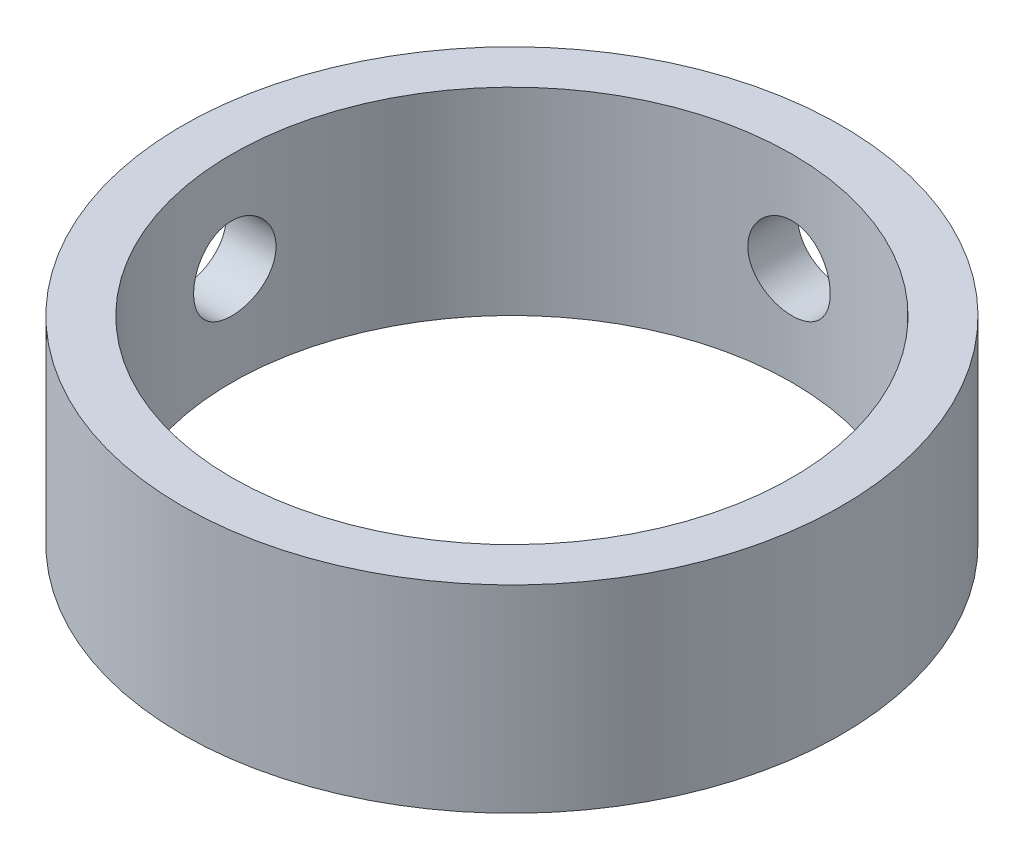
ISO-10303-21;
HEADER;
FILE_DESCRIPTION(('STEP AP214'),'2;1');
FILE_NAME('part.step','',(''),(''),'','','');
FILE_SCHEMA(('AUTOMOTIVE_DESIGN { 1 0 10303 214 1 1 1 1 }'));
ENDSEC;
DATA;
#1=APPLICATION_CONTEXT('core data for automotive mechanical design processes');
#2=APPLICATION_PROTOCOL_DEFINITION('international standard','automotive_design',2000,#1);
#3=PRODUCT_CONTEXT('',#1,'mechanical');
#4=PRODUCT('Part','Part','',(#3));
#5=PRODUCT_RELATED_PRODUCT_CATEGORY('part','',(#4));
#6=PRODUCT_DEFINITION_FORMATION('','',#4);
#7=PRODUCT_DEFINITION_CONTEXT('part definition',#1,'design');
#8=PRODUCT_DEFINITION('design','',#6,#7);
#9=PRODUCT_DEFINITION_SHAPE('','',#8);
#10=(LENGTH_UNIT() NAMED_UNIT(*) SI_UNIT(.MILLI.,.METRE.));
#11=(NAMED_UNIT(*) PLANE_ANGLE_UNIT() SI_UNIT($,.RADIAN.));
#12=(NAMED_UNIT(*) SI_UNIT($,.STERADIAN.) SOLID_ANGLE_UNIT());
#13=UNCERTAINTY_MEASURE_WITH_UNIT(LENGTH_MEASURE(1.E-05),#10,'distance_accuracy_value','');
#14=(GEOMETRIC_REPRESENTATION_CONTEXT(3) GLOBAL_UNCERTAINTY_ASSIGNED_CONTEXT((#13)) GLOBAL_UNIT_ASSIGNED_CONTEXT((#10,
#11,#12)) REPRESENTATION_CONTEXT('',''));
#15=CARTESIAN_POINT('',(0.,0.,0.));
#16=DIRECTION('',(0.,0.,1.));
#17=DIRECTION('',(1.,0.,0.));
#18=AXIS2_PLACEMENT_3D('',#15,#16,#17);
#19=CARTESIAN_POINT('',(0.,12.,0.));
#20=DIRECTION('',(0.,-1.,0.));
#21=DIRECTION('',(0.,0.,-1.));
#22=AXIS2_PLACEMENT_3D('',#19,#20,#21);
#23=CYLINDRICAL_SURFACE('',#22,20.);
#24=CARTESIAN_POINT('',(0.,12.,0.));
#25=DIRECTION('',(0.,1.,0.));
#26=DIRECTION('',(0.,0.,1.));
#27=AXIS2_PLACEMENT_3D('',#24,#25,#26);
#28=CIRCLE('',#27,20.);
#29=CARTESIAN_POINT('',(0.,12.,20.));
#30=VERTEX_POINT('',#29);
#31=EDGE_CURVE('E10',#30,#30,#28,.T.);
#32=ORIENTED_EDGE('',*,*,#31,.F.);
#33=EDGE_LOOP('',(#32));
#34=FACE_BOUND('',#33,.T.);
#35=CARTESIAN_POINT('',(0.,0.,0.));
#36=DIRECTION('',(0.,1.,0.));
#37=DIRECTION('',(0.,0.,1.));
#38=AXIS2_PLACEMENT_3D('',#35,#36,#37);
#39=CIRCLE('',#38,20.);
#40=CARTESIAN_POINT('',(0.,0.,20.));
#41=VERTEX_POINT('',#40);
#42=EDGE_CURVE('E27',#41,#41,#39,.T.);
#43=ORIENTED_EDGE('',*,*,#42,.T.);
#44=EDGE_LOOP('',(#43));
#45=FACE_BOUND('',#44,.T.);
#46=CARTESIAN_POINT('',(0.,8.5,-20.));
#47=CARTESIAN_POINT('',(0.139841095555761,8.49999405906428,-19.9999980489643));
#48=CARTESIAN_POINT('',(0.279769574302746,8.48822712083072,-19.998517845549));
#49=CARTESIAN_POINT('',(0.555732802089752,8.44147224542921,-19.9927554011136));
#50=CARTESIAN_POINT('',(0.691763330623745,8.40646006207662,-19.9884702344143));
#51=CARTESIAN_POINT('',(0.955895574813054,8.31426235608592,-19.9775806104441));
#52=CARTESIAN_POINT('',(1.08400256014614,8.25709175819015,-19.9709777145554));
#53=CARTESIAN_POINT('',(1.32877947489303,8.12223271603021,-19.956187008781));
#54=CARTESIAN_POINT('',(1.44545136155637,8.04454779146929,-19.9479994708411));
#55=CARTESIAN_POINT('',(1.66471281693132,7.87040805016041,-19.9309032130632));
#56=CARTESIAN_POINT('',(1.76723036493713,7.77386287065376,-19.9219911469242));
#57=CARTESIAN_POINT('',(1.95465279355749,7.56493717646336,-19.9044772600975));
#58=CARTESIAN_POINT('',(2.03955677639225,7.45255585508675,-19.8958754552427));
#59=CARTESIAN_POINT('',(2.18961016128394,7.21468002243433,-19.8799230561958));
#60=CARTESIAN_POINT('',(2.25469209594107,7.08914263843206,-19.8725767717791));
#61=CARTESIAN_POINT('',(2.36282307657512,6.82881294805264,-19.8600112845768));
#62=CARTESIAN_POINT('',(2.40587295806522,6.69402099285299,-19.8547920011314));
#63=CARTESIAN_POINT('',(2.46849898002476,6.41975580441324,-19.8471033960362));
#64=CARTESIAN_POINT('',(2.4881967147317,6.28031074229581,-19.8446198343675));
#65=CARTESIAN_POINT('',(2.50393554955723,6.00007373652817,-19.8426402814279));
#66=CARTESIAN_POINT('',(2.49997760100242,5.85928184726871,-19.8431441700151));
#67=CARTESIAN_POINT('',(2.4686172364479,5.58119517275122,-19.8470695536975));
#68=CARTESIAN_POINT('',(2.4413487629847,5.44388501379974,-19.8504743796033));
#69=CARTESIAN_POINT('',(2.36435038318205,5.17580497878102,-19.8597919975763));
#70=CARTESIAN_POINT('',(2.31462002175191,5.04503523528596,-19.8657048404572));
#71=CARTESIAN_POINT('',(2.19396555991165,4.79333200097831,-19.8793911586465));
#72=CARTESIAN_POINT('',(2.12298325370764,4.67242669975102,-19.8871697321144));
#73=CARTESIAN_POINT('',(1.96188146945692,4.44419330558675,-19.903707114306));
#74=CARTESIAN_POINT('',(1.87176111608078,4.33686583402632,-19.9124659678566));
#75=CARTESIAN_POINT('',(1.67419911075378,4.13805728927726,-19.9300510989043));
#76=CARTESIAN_POINT('',(1.56664200784001,4.04669090823402,-19.9388774238689));
#77=CARTESIAN_POINT('',(1.33765716911392,3.88329111996945,-19.9555463255585));
#78=CARTESIAN_POINT('',(1.21622940131825,3.811257757328,-19.9633889000151));
#79=CARTESIAN_POINT('',(0.962861671363482,3.68856867953609,-19.9772115221858));
#80=CARTESIAN_POINT('',(0.830918195337718,3.63792014611877,-19.9831909440154));
#81=CARTESIAN_POINT('',(0.560307940431058,3.55952950647675,-19.9926078578006));
#82=CARTESIAN_POINT('',(0.421641476630668,3.53178632786295,-19.9960454687587));
#83=CARTESIAN_POINT('',(0.142513163913498,3.50014257573945,-19.9999759641076));
#84=CARTESIAN_POINT('',(0.00206949019860751,3.49608400763593,-20.0004883614263));
#85=CARTESIAN_POINT('',(-0.277496036497496,3.51150773405595,-19.9985633800543));
#86=CARTESIAN_POINT('',(-0.416617917564706,3.53098952725159,-19.9961260641821));
#87=CARTESIAN_POINT('',(-0.689124507721522,3.59280970877438,-19.9885876875669));
#88=CARTESIAN_POINT('',(-0.822526570424705,3.63507276340263,-19.9834954081387));
#89=CARTESIAN_POINT('',(-1.08034965485841,3.74117745191292,-19.971217231002));
#90=CARTESIAN_POINT('',(-1.20477037146531,3.80501981849143,-19.9640312622062));
#91=CARTESIAN_POINT('',(-1.44180452068743,3.95285313750746,-19.9483182291011));
#92=CARTESIAN_POINT('',(-1.55435375994382,4.03694628980564,-19.9397844404251));
#93=CARTESIAN_POINT('',(-1.76379698962632,4.2227494975342,-19.9223514232566));
#94=CARTESIAN_POINT('',(-1.86069035833686,4.32446025225099,-19.913452180269));
#95=CARTESIAN_POINT('',(-2.03663195881802,4.54330741675714,-19.8962310546259));
#96=CARTESIAN_POINT('',(-2.11557546056793,4.66052834631039,-19.8879127472133));
#97=CARTESIAN_POINT('',(-2.2526528894435,4.90665824485471,-19.8728541103715));
#98=CARTESIAN_POINT('',(-2.31078723372837,5.03556697947652,-19.8661137493103));
#99=CARTESIAN_POINT('',(-2.40442657886654,5.30107531914762,-19.8549985039299));
#100=CARTESIAN_POINT('',(-2.43999062745711,5.43765383004798,-19.8506174518479));
#101=CARTESIAN_POINT('',(-2.48766999386785,5.71490248378067,-19.8446991590745));
#102=CARTESIAN_POINT('',(-2.49978640253576,5.85557243595901,-19.8431617860877));
#103=CARTESIAN_POINT('',(-2.50020653608484,6.13596892920468,-19.8431087698245));
#104=CARTESIAN_POINT('',(-2.48867479769927,6.27569524833189,-19.8445722475195));
#105=CARTESIAN_POINT('',(-2.44247440484932,6.55120712934508,-19.850311145372));
#106=CARTESIAN_POINT('',(-2.40780574790577,6.68699269080879,-19.8545865658308));
#107=CARTESIAN_POINT('',(-2.31636707368966,6.9507469567664,-19.8654611577455));
#108=CARTESIAN_POINT('',(-2.25960498097093,7.07871844502181,-19.8720594959278));
#109=CARTESIAN_POINT('',(-2.12560690215031,7.32334665404831,-19.8868378324482));
#110=CARTESIAN_POINT('',(-2.04837065950959,7.44000323301983,-19.8950178506041));
#111=CARTESIAN_POINT('',(-1.87500633126584,7.65953122534047,-19.9121060475223));
#112=CARTESIAN_POINT('',(-1.77875562577496,7.76230546095498,-19.9210187208403));
#113=CARTESIAN_POINT('',(-1.57035022696838,7.95030682516797,-19.938528315929));
#114=CARTESIAN_POINT('',(-1.45819178914157,8.03552981077431,-19.9471251627559));
#115=CARTESIAN_POINT('',(-1.22066562085421,8.18628535710529,-19.9630705658675));
#116=CARTESIAN_POINT('',(-1.09524927959617,8.25174180589926,-19.970414250783));
#117=CARTESIAN_POINT('',(-0.835182902301284,8.36057124291628,-19.9829764907672));
#118=CARTESIAN_POINT('',(-0.700543080870238,8.40396822635345,-19.9881973536957));
#119=CARTESIAN_POINT('',(-0.471005771967927,8.4570593381713,-19.9946672032774));
#120=CARTESIAN_POINT('',(-0.377555663516923,8.47313894198206,-19.9966572589545));
#121=CARTESIAN_POINT('',(-0.189417063212437,8.49461124569322,-19.9993243132919));
#122=CARTESIAN_POINT('',(-0.094728580496028,8.5000040243993,-20.0000013216347));
#123=CARTESIAN_POINT('',(0.,8.5,-20.));
#124=B_SPLINE_CURVE_WITH_KNOTS('',3,(#46,#47,#48,#49,#50,#51,#52,#53,#54,#55,#56,#57,#58,#59,
#60,#61,#62,#63,#64,#65,#66,#67,#68,#69,#70,#71,#72,#73,#74,#75,#76,#77,#78,#79,#80,#81,#82,#83,
#84,#85,#86,#87,#88,#89,#90,#91,#92,#93,#94,#95,#96,#97,#98,#99,#100,#101,#102,#103,#104,#105,
#106,#107,#108,#109,#110,#111,#112,#113,#114,#115,#116,#117,#118,#119,#120,#121,#122,#123),
.UNSPECIFIED.,.T.,.F.,(4,2,2,2,2,2,2,2,2,2,2,2,2,2,2,2,2,2,2,2,2,2,2,2,2,2,2,2,2,2,2,2,2,2,2,2,
2,2,4),(0.,0.419177272776246,0.838792460943426,1.25812550818177,1.67738665591073,
2.09870813201843,2.52005107800011,2.9428125031887,3.36555789496807,3.78609225286321,
4.20660969884663,4.62472696441692,5.04285270166241,5.46213426285534,5.88143500513639,
6.30363478136417,6.72583553113114,7.14817795731605,7.5705006090378,7.99000279391921,
8.40949604501929,8.82761053893396,9.24573923078948,9.66602402928422,10.0863255137509,
10.5090197150757,10.9317054422154,11.3532807428093,11.7748364301062,12.1934690120222,
12.6121016387955,13.0305842470649,13.4490720991226,13.8703523769183,14.2917319847001,
14.7147140303685,15.1372349868403,15.4211884318763,15.7051397830044),.UNSPECIFIED.);
#125=CARTESIAN_POINT('',(0.,8.5,-20.));
#126=VERTEX_POINT('',#125);
#127=EDGE_CURVE('E43',#126,#126,#124,.T.);
#128=ORIENTED_EDGE('',*,*,#127,.F.);
#129=EDGE_LOOP('',(#128));
#130=FACE_BOUND('',#129,.T.);
#131=CARTESIAN_POINT('',(-19.8431348329845,6.,2.5));
#132=CARTESIAN_POINT('',(-19.8431368414674,6.13983628380046,2.49999405483338));
#133=CARTESIAN_POINT('',(-19.8446289499888,6.2797599649306,2.48822789901659));
#134=CARTESIAN_POINT('',(-19.8504339085542,6.55571322542846,2.44147641371667));
#135=CARTESIAN_POINT('',(-19.8547497060959,6.69173858050178,2.4064668210908));
#136=CARTESIAN_POINT('',(-19.8657057380876,6.95585988210762,2.31427669282773));
#137=CARTESIAN_POINT('',(-19.8723443946258,7.08396114211641,2.25711120479872));
#138=CARTESIAN_POINT('',(-19.8871962351098,7.32872845182533,2.12226419842905));
#139=CARTESIAN_POINT('',(-19.8954091498188,7.44539645174366,2.04458618737466));
#140=CARTESIAN_POINT('',(-19.9125355924631,7.66466224712152,1.87045345026455));
#141=CARTESIAN_POINT('',(-19.9214524170269,7.76718680231872,1.77390681502433));
#142=CARTESIAN_POINT('',(-19.9389523287519,7.95462276893924,1.56497526067119));
#143=CARTESIAN_POINT('',(-19.9475353992921,8.03953330409474,1.45258955405802));
#144=CARTESIAN_POINT('',(-19.96343444613,8.18959357950632,1.21470983067598));
#145=CARTESIAN_POINT('',(-19.9707461384685,8.25467704509965,1.08917369556111));
#146=CARTESIAN_POINT('',(-19.9832423695448,8.36281119994098,0.828846718055913));
#147=CARTESIAN_POINT('',(-19.9884269872295,8.40586270692652,0.694056219360904));
#148=CARTESIAN_POINT('',(-19.9960616870624,8.46849206833442,0.419795687751112));
#149=CARTESIAN_POINT('',(-19.9985259483594,8.48819167852389,0.280353859663377));
#150=CARTESIAN_POINT('',(-20.0004906972921,8.50393538503654,0.000123200686544896));
#151=CARTESIAN_POINT('',(-19.9999913015208,8.49998041195255,-0.140665576994773));
#152=CARTESIAN_POINT('',(-19.9960964777001,8.46862479724258,-0.418765268974549));
#153=CARTESIAN_POINT('',(-19.9927172245573,8.44135510151863,-0.556091205764454));
#154=CARTESIAN_POINT('',(-19.9834605594233,8.36434882337007,-0.824202163905376));
#155=CARTESIAN_POINT('',(-19.9775830999405,8.31461181383317,-0.954987060856207));
#156=CARTESIAN_POINT('',(-19.9639625780791,8.19394350721621,-1.20670881543864));
#157=CARTESIAN_POINT('',(-19.9562145384324,8.12295554226982,-1.32761822784052));
#158=CARTESIAN_POINT('',(-19.9397196906528,7.96184163778397,-1.55585745230648));
#159=CARTESIAN_POINT('',(-19.9309728367226,7.87171482053143,-1.66318664121736));
#160=CARTESIAN_POINT('',(-19.9133886752352,7.67414818140162,-1.86198803077295));
#161=CARTESIAN_POINT('',(-19.9045511580473,7.56659424045334,-1.953346839996));
#162=CARTESIAN_POINT('',(-19.8878407194058,7.33761844321755,-2.11673285062511));
#163=CARTESIAN_POINT('',(-19.8799678009758,7.21619654346195,-2.1887599914351));
#164=CARTESIAN_POINT('',(-19.8660780261272,6.96283050443768,-2.31144457358274));
#165=CARTESIAN_POINT('',(-19.8600619590813,6.8308819200468,-2.36209292986233));
#166=CARTESIAN_POINT('',(-19.8505824249596,6.56026054647317,-2.44048165446809));
#167=CARTESIAN_POINT('',(-19.847118834867,6.42158808169128,-2.46822312679962));
#168=CARTESIAN_POINT('',(-19.8431588878405,6.14245681800023,-2.49986043190861));
#169=CARTESIAN_POINT('',(-19.8426426744238,6.0020163769112,-2.50391584199829));
#170=CARTESIAN_POINT('',(-19.8445834111965,5.72245807033458,-2.48848695323056));
#171=CARTESIAN_POINT('',(-19.8470402980145,5.58334017672068,-2.46900315610981));
#172=CARTESIAN_POINT('',(-19.8546322848399,5.31085423642213,-2.40718328579773));
#173=CARTESIAN_POINT('',(-19.8597583269466,5.17746838480959,-2.36492448374606));
#174=CARTESIAN_POINT('',(-19.8721036997081,4.91967584514684,-2.25883371911613));
#175=CARTESIAN_POINT('',(-19.8793231039076,4.79526947275913,-2.19500099858123));
#176=CARTESIAN_POINT('',(-19.8950893135323,4.55824535618701,-2.04718202215492));
#177=CARTESIAN_POINT('',(-19.9036429273708,4.44569333468558,-1.96309111957711));
#178=CARTESIAN_POINT('',(-19.9210923955102,4.23624344606497,-1.77729074236895));
#179=CARTESIAN_POINT('',(-19.9299882631129,4.13934618813202,-1.67558058242548));
#180=CARTESIAN_POINT('',(-19.9471808868696,3.96339581266559,-1.45673177555852));
#181=CARTESIAN_POINT('',(-19.9554739391252,3.88444755320501,-1.33950849211703));
#182=CARTESIAN_POINT('',(-19.9704711303161,3.74736178236621,-1.09337258168179));
#183=CARTESIAN_POINT('',(-19.9771753012772,3.68922385151903,-0.964460190368322));
#184=CARTESIAN_POINT('',(-19.9882229065319,3.59558221309197,-0.698953859139454));
#185=CARTESIAN_POINT('',(-19.992572656877,3.56001790396839,-0.562381566511779));
#186=CARTESIAN_POINT('',(-19.9984475467757,3.51233591077324,-0.285146057277959));
#187=CARTESIAN_POINT('',(-19.9999728137019,3.50021716940077,-0.144483025438105));
#188=CARTESIAN_POINT('',(-20.0000262801366,3.49979007770784,0.135917183343781));
#189=CARTESIAN_POINT('',(-19.998574831678,3.51132003943201,0.275654137714726));
#190=CARTESIAN_POINT('',(-19.9928784115798,3.55752061343085,0.551187741452621));
#191=CARTESIAN_POINT('',(-19.9886334418829,3.59219120961182,0.686984393559879));
#192=CARTESIAN_POINT('',(-19.9778248521189,3.68363811434963,0.950761442987288));
#193=CARTESIAN_POINT('',(-19.9712620443393,3.74040667937299,1.07874456015946));
#194=CARTESIAN_POINT('',(-19.9565444760682,3.87442131460779,1.32339333714413));
#195=CARTESIAN_POINT('',(-19.9483896966512,3.95166762826256,1.44005886238844));
#196=CARTESIAN_POINT('',(-19.9313319392356,4.12504321533551,1.65958676796215));
#197=CARTESIAN_POINT('',(-19.9224244127137,4.22129279352037,1.76235378783277));
#198=CARTESIAN_POINT('',(-19.9049015902109,4.42969294403215,1.95034111882088));
#199=CARTESIAN_POINT('',(-19.8962863639518,4.54184727750316,2.03555726779921));
#200=CARTESIAN_POINT('',(-19.8802881136638,4.779369922687,2.18630524251152));
#201=CARTESIAN_POINT('',(-19.8729099764648,4.90478758989319,2.25175978314741));
#202=CARTESIAN_POINT('',(-19.8602785801803,5.16485674055252,2.36058528832414));
#203=CARTESIAN_POINT('',(-19.8550230113382,5.29949799929233,2.40398027122394));
#204=CARTESIAN_POINT('',(-19.8485078683333,5.52902998704918,2.4570658962405));
#205=CARTESIAN_POINT('',(-19.8465030152112,5.62247295153974,2.47314303101111));
#206=CARTESIAN_POINT('',(-19.8438158223071,5.81059724996476,2.49461205590498));
#207=CARTESIAN_POINT('',(-19.8431334724909,5.90527857449791,2.50000402709971));
#208=CARTESIAN_POINT('',(-19.8431348329845,6.,2.5));
#209=B_SPLINE_CURVE_WITH_KNOTS('',3,(#131,#132,#133,#134,#135,#136,#137,#138,#139,#140,#141,
#142,#143,#144,#145,#146,#147,#148,#149,#150,#151,#152,#153,#154,#155,#156,#157,#158,#159,#160,
#161,#162,#163,#164,#165,#166,#167,#168,#169,#170,#171,#172,#173,#174,#175,#176,#177,#178,#179,
#180,#181,#182,#183,#184,#185,#186,#187,#188,#189,#190,#191,#192,#193,#194,#195,#196,#197,#198,
#199,#200,#201,#202,#203,#204,#205,#206,#207,#208),.UNSPECIFIED.,.T.,.F.,(4,2,2,2,2,2,2,2,2,2,2,
2,2,2,2,2,2,2,2,2,2,2,2,2,2,2,2,2,2,2,2,2,2,2,2,2,2,2,4),(0.,0.41916281749166,0.838763876176507,
1.25808045260532,1.67732537953025,2.09866577551479,2.52002712744992,2.94278186148153,
3.36552090342243,3.7860459694387,4.20655449172521,4.62471664935451,5.04288675674202,
5.46218204415217,5.88149656471517,6.30367697380183,6.72585870621838,7.14821966741422,
7.57056027158602,7.99005217808296,8.40953514329529,8.82760376295146,9.24568707214266,
9.66597819546524,10.0862856699722,10.5089888589476,10.9316835271129,11.3532385678735,
11.7747745977523,12.1934381629067,12.612101436892,13.030618135465,13.4491398096666,
13.8704012889325,14.2917625544224,14.7147509770793,15.1372778598593,15.4212098963687,
15.7051397785939),.UNSPECIFIED.);
#210=CARTESIAN_POINT('',(-19.8431348329845,6.,2.5));
#211=VERTEX_POINT('',#210);
#212=EDGE_CURVE('E44',#211,#211,#209,.T.);
#213=ORIENTED_EDGE('',*,*,#212,.F.);
#214=EDGE_LOOP('',(#213));
#215=FACE_BOUND('',#214,.T.);
#216=ADVANCED_FACE('F14',(#34,#45,#130,#215),#23,.T.);
#217=CARTESIAN_POINT('',(0.,12.,0.));
#218=DIRECTION('',(0.,-1.,0.));
#219=DIRECTION('',(0.,0.,-1.));
#220=AXIS2_PLACEMENT_3D('',#217,#218,#219);
#221=CYLINDRICAL_SURFACE('',#220,17.);
#222=CARTESIAN_POINT('',(0.,8.5,-17.));
#223=CARTESIAN_POINT('',(0.139618263933644,8.4999942181081,-16.999997793131));
#224=CARTESIAN_POINT('',(0.279318334742722,8.48826456512113,-16.9982619631343));
#225=CARTESIAN_POINT('',(0.554815864347195,8.44166648859107,-16.9915044414465));
#226=CARTESIAN_POINT('',(0.690609351356019,8.40677532804721,-16.9864795210156));
#227=CARTESIAN_POINT('',(0.954266664820791,8.31491747338719,-16.9737086836159));
#228=CARTESIAN_POINT('',(1.08213631987448,8.25796723451278,-16.9659647952965));
#229=CARTESIAN_POINT('',(1.3264840365203,8.12364753379347,-16.9486124241397));
#230=CARTESIAN_POINT('',(1.44296372374599,8.0462809917132,-16.9390042079744));
#231=CARTESIAN_POINT('',(1.66212119979329,7.87270465235348,-16.9189113868221));
#232=CARTESIAN_POINT('',(1.76470092382526,7.77637165727851,-16.9084213236713));
#233=CARTESIAN_POINT('',(1.95230070871523,7.56786201635141,-16.887789985922));
#234=CARTESIAN_POINT('',(2.03731977497712,7.45568447370533,-16.8776487311065));
#235=CARTESIAN_POINT('',(2.18776463859896,7.21801373636616,-16.8588102121396));
#236=CARTESIAN_POINT('',(2.25309591742832,7.09246010427653,-16.8501200004422));
#237=CARTESIAN_POINT('',(2.36170671911329,6.83201297323057,-16.8352417558288));
#238=CARTESIAN_POINT('',(2.40498739680279,6.69711996381641,-16.8290535918792));
#239=CARTESIAN_POINT('',(2.46796464304165,6.42285300628695,-16.819933589302));
#240=CARTESIAN_POINT('',(2.4878288374678,6.28351833167848,-16.8169786171038));
#241=CARTESIAN_POINT('',(2.50392846030982,6.00346438611801,-16.8145892786749));
#242=CARTESIAN_POINT('',(2.50016519348747,5.86274519205078,-16.8151547180392));
#243=CARTESIAN_POINT('',(2.46925378270774,5.58509880515093,-16.8197211578168));
#244=CARTESIAN_POINT('',(2.44229207080977,5.44815034087365,-16.8236947679923));
#245=CARTESIAN_POINT('',(2.36604083270518,5.18074255570013,-16.8345870467401));
#246=CARTESIAN_POINT('',(2.31675069735605,5.05028341194703,-16.8415057956586));
#247=CARTESIAN_POINT('',(2.19704705914094,4.79898878161491,-16.857539142223));
#248=CARTESIAN_POINT('',(2.12655433007144,4.67819157954196,-16.8666619500121));
#249=CARTESIAN_POINT('',(1.96650298810832,4.45006995910381,-16.8860695216999));
#250=CARTESIAN_POINT('',(1.87694317178514,4.34274639181437,-16.8963543589216));
#251=CARTESIAN_POINT('',(1.6802753243751,4.1435378637112,-16.9170482652418));
#252=CARTESIAN_POINT('',(1.57300695254414,4.05181115009009,-16.9274575785055));
#253=CARTESIAN_POINT('',(1.34451413749425,3.88763830975104,-16.9471357134677));
#254=CARTESIAN_POINT('',(1.22328963737823,3.81519226164154,-16.9564045305161));
#255=CARTESIAN_POINT('',(0.970190436846702,3.69163011353676,-16.9727664753804));
#256=CARTESIAN_POINT('',(0.838309834869858,3.64052593107167,-16.9798583870044));
#257=CARTESIAN_POINT('',(0.567710944898677,3.56123422839847,-16.991057196357));
#258=CARTESIAN_POINT('',(0.428993101669629,3.53304521963036,-16.9951642879764));
#259=CARTESIAN_POINT('',(0.150023519282231,3.50059379681278,-16.9999050818337));
#260=CARTESIAN_POINT('',(0.00979761097236577,3.4961137704723,-17.0005703732726));
#261=CARTESIAN_POINT('',(-0.269403415413675,3.51063029513393,-16.9984385067869));
#262=CARTESIAN_POINT('',(-0.408378570541141,3.52962614838472,-16.9956414517703));
#263=CARTESIAN_POINT('',(-0.680476104424863,3.59037427213088,-16.9869187192332));
#264=CARTESIAN_POINT('',(-0.813622595189719,3.63202080910918,-16.9810075822558));
#265=CARTESIAN_POINT('',(-1.07104301967474,3.73677680702144,-16.9667174597167));
#266=CARTESIAN_POINT('',(-1.19531655049811,3.7998872418232,-16.9583383621802));
#267=CARTESIAN_POINT('',(-1.43242218615397,3.94629211293999,-16.9399652839742));
#268=CARTESIAN_POINT('',(-1.54516798121673,4.02972493574426,-16.9299603948874));
#269=CARTESIAN_POINT('',(-1.75513489222198,4.21421317128843,-16.9094840590999));
#270=CARTESIAN_POINT('',(-1.85235514217674,4.31526956638309,-16.8990125864158));
#271=CARTESIAN_POINT('',(-2.02930056628108,4.53310384208332,-16.8786834541762));
#272=CARTESIAN_POINT('',(-2.10888006584901,4.65000065064076,-16.8688313544642));
#273=CARTESIAN_POINT('',(-2.24727323997786,4.89563010732928,-16.8509540599789));
#274=CARTESIAN_POINT('',(-2.3060874583028,5.02436244542142,-16.8429288173692));
#275=CARTESIAN_POINT('',(-2.40105348668989,5.28956983118956,-16.8296538581595));
#276=CARTESIAN_POINT('',(-2.43728264767767,5.42601668637408,-16.8243946779348));
#277=CARTESIAN_POINT('',(-2.48629673443479,5.70314115317623,-16.8172219020188));
#278=CARTESIAN_POINT('',(-2.4990832109862,5.84381848431332,-16.815308085025));
#279=CARTESIAN_POINT('',(-2.50081314025998,6.12395898989844,-16.8150507670264));
#280=CARTESIAN_POINT('',(-2.48998561242761,6.26342077278041,-16.8166729719777));
#281=CARTESIAN_POINT('',(-2.4452849279886,6.53851731267613,-16.8232304869987));
#282=CARTESIAN_POINT('',(-2.41141180268506,6.67415207488791,-16.8281657925681));
#283=CARTESIAN_POINT('',(-2.32166128628094,6.93768511955507,-16.8407816094163));
#284=CARTESIAN_POINT('',(-2.265799280287,7.06558873928598,-16.8484602009356));
#285=CARTESIAN_POINT('',(-2.13367943489691,7.31024522687879,-16.8656998369544));
#286=CARTESIAN_POINT('',(-2.05742095912403,7.42699774666834,-16.8752609401864));
#287=CARTESIAN_POINT('',(-1.88583847980749,7.64720241778312,-16.8952988011725));
#288=CARTESIAN_POINT('',(-1.79034469442663,7.75052159434606,-16.9057832085905));
#289=CARTESIAN_POINT('',(-1.58336095356046,7.93975078053958,-16.92642201351));
#290=CARTESIAN_POINT('',(-1.47186727949618,8.02565673188524,-16.9365763336203));
#291=CARTESIAN_POINT('',(-1.23535773881122,8.17802419179684,-16.9554718925698));
#292=CARTESIAN_POINT('',(-1.11027358494527,8.24438064153127,-16.9642053874589));
#293=CARTESIAN_POINT('',(-0.850667584310129,8.35504430031826,-16.9791991247469));
#294=CARTESIAN_POINT('',(-0.716155741284794,8.39937448911674,-16.9854619433621));
#295=CARTESIAN_POINT('',(-0.484190218187675,8.45459952939809,-16.9933688461727));
#296=CARTESIAN_POINT('',(-0.388172624228652,8.47159888675541,-16.9958428419025));
#297=CARTESIAN_POINT('',(-0.194783283695077,8.4943010729119,-16.9991591791261));
#298=CARTESIAN_POINT('',(-0.0974115529944627,8.50000403402144,-17.0000015397308));
#299=CARTESIAN_POINT('',(0.,8.5,-17.));
#300=B_SPLINE_CURVE_WITH_KNOTS('',3,(#222,#223,#224,#225,#226,#227,#228,#229,#230,#231,#232,
#233,#234,#235,#236,#237,#238,#239,#240,#241,#242,#243,#244,#245,#246,#247,#248,#249,#250,#251,
#252,#253,#254,#255,#256,#257,#258,#259,#260,#261,#262,#263,#264,#265,#266,#267,#268,#269,#270,
#271,#272,#273,#274,#275,#276,#277,#278,#279,#280,#281,#282,#283,#284,#285,#286,#287,#288,#289,
#290,#291,#292,#293,#294,#295,#296,#297,#298,#299),.UNSPECIFIED.,.T.,.F.,(4,2,2,2,2,2,2,2,2,2,2,
2,2,2,2,2,2,2,2,2,2,2,2,2,2,2,2,2,2,2,2,2,2,2,2,2,2,2,4),(0.,0.418498857511903,
0.837409152330181,1.25600755579684,1.67454612732146,2.09589880308585,2.51727533677714,
2.94064374704006,3.36398998237661,3.78428694551126,4.20456069910212,4.62148817747431,
5.03842703074503,5.45694360373012,5.87548659945093,6.29805109091574,6.72061730517519,
7.14341917050654,7.56619356861207,7.98508072630458,8.40395543411032,8.82089140788565,
9.23784630155638,9.65772400348285,10.0776251172785,10.5008742387869,10.9241122761825,
11.3458926970847,11.7676452153327,12.1853255880243,12.6030053933771,13.0203934758991,
13.4377945825891,13.8590554809119,14.2804144447029,14.7039981269519,15.1271389563846,
15.4191287002785,15.7111150241882),.UNSPECIFIED.);
#301=CARTESIAN_POINT('',(0.,8.5,-17.));
#302=VERTEX_POINT('',#301);
#303=EDGE_CURVE('E37',#302,#302,#300,.T.);
#304=ORIENTED_EDGE('',*,*,#303,.T.);
#305=EDGE_LOOP('',(#304));
#306=FACE_BOUND('',#305,.T.);
#307=CARTESIAN_POINT('',(0.,12.,0.));
#308=DIRECTION('',(0.,1.,0.));
#309=DIRECTION('',(0.,0.,1.));
#310=AXIS2_PLACEMENT_3D('',#307,#308,#309);
#311=CIRCLE('',#310,17.);
#312=CARTESIAN_POINT('',(0.,12.,17.));
#313=VERTEX_POINT('',#312);
#314=EDGE_CURVE('E32',#313,#313,#311,.T.);
#315=ORIENTED_EDGE('',*,*,#314,.T.);
#316=EDGE_LOOP('',(#315));
#317=FACE_BOUND('',#316,.T.);
#318=CARTESIAN_POINT('',(0.,0.,0.));
#319=DIRECTION('',(0.,1.,0.));
#320=DIRECTION('',(0.,0.,1.));
#321=AXIS2_PLACEMENT_3D('',#318,#319,#320);
#322=CIRCLE('',#321,17.);
#323=CARTESIAN_POINT('',(0.,0.,17.));
#324=VERTEX_POINT('',#323);
#325=EDGE_CURVE('E35',#324,#324,#322,.T.);
#326=ORIENTED_EDGE('',*,*,#325,.F.);
#327=EDGE_LOOP('',(#326));
#328=FACE_BOUND('',#327,.T.);
#329=CARTESIAN_POINT('',(-16.8151717208003,6.,2.5));
#330=CARTESIAN_POINT('',(-16.8151740185166,6.13960906148192,2.49999421020369));
#331=CARTESIAN_POINT('',(-16.8169291988967,6.27929995486534,2.48826605121617));
#332=CARTESIAN_POINT('',(-16.8237557916967,6.55477842002669,2.44167444753415));
#333=CARTESIAN_POINT('',(-16.8288304679333,6.69056201272335,2.40678823272199));
#334=CARTESIAN_POINT('',(-16.8417091295973,6.95419839191177,2.3149448422647));
#335=CARTESIAN_POINT('',(-16.8495110507939,7.08205709076528,2.25800435581721));
#336=CARTESIAN_POINT('',(-16.8669626686957,7.3263864039983,2.12370763056537));
#337=CARTESIAN_POINT('',(-16.8766121032081,7.44285863076834,2.04635428809548));
#338=CARTESIAN_POINT('',(-16.8967545847397,7.66202434302888,1.87279136125537));
#339=CARTESIAN_POINT('',(-16.907252982425,7.76461744487372,1.77645562325415));
#340=CARTESIAN_POINT('',(-16.9278626867034,7.95224310302877,1.56793485448318));
#341=CARTESIAN_POINT('',(-16.9379739722539,8.03727470583521,1.45574896368403));
#342=CARTESIAN_POINT('',(-16.9567260318457,8.18773282906593,1.2180707254503));
#343=CARTESIAN_POINT('',(-16.9653598065303,8.25306709238781,1.09251937696104));
#344=CARTESIAN_POINT('',(-16.9801248418252,8.36168403912428,0.832077202708482));
#345=CARTESIAN_POINT('',(-16.9862562296358,8.40496784342736,0.697186852069654));
#346=CARTESIAN_POINT('',(-16.995287909029,8.46795140200924,0.422928796990461));
#347=CARTESIAN_POINT('',(-16.998211203127,8.48781913020422,0.283600437619454));
#348=CARTESIAN_POINT('',(-17.0005761209488,8.50392800954728,0.00355891361205851));
#349=CARTESIAN_POINT('',(-17.0000179310585,8.50017042550936,-0.137154176488152));
#350=CARTESIAN_POINT('',(-16.9955011819607,8.46926816315221,-0.414825218535945));
#351=CARTESIAN_POINT('',(-16.9915688971587,8.44230419034891,-0.551803769365082));
#352=CARTESIAN_POINT('',(-16.9807750785218,8.36603806027492,-0.819270554274912));
#353=CARTESIAN_POINT('',(-16.9739134716894,8.31673534633206,-0.949758626525636));
#354=CARTESIAN_POINT('',(-16.9579867877463,8.19700535761945,-1.20108890904549));
#355=CARTESIAN_POINT('',(-16.9489137703188,8.12650174049244,-1.32189422731169));
#356=CARTESIAN_POINT('',(-16.9295759486806,7.96642699469264,-1.55002749324877));
#357=CARTESIAN_POINT('',(-16.9193110690425,7.8768546589482,-1.65735458704856));
#358=CARTESIAN_POINT('',(-16.8986202553188,7.68017773851109,-1.85654954239533));
#359=CARTESIAN_POINT('',(-16.8881937160666,7.57291541627695,-1.94826166688123));
#360=CARTESIAN_POINT('',(-16.8684495185282,7.34443997041283,-2.11240792664068));
#361=CARTESIAN_POINT('',(-16.859131866578,7.22322676707911,-2.18484195176736));
#362=CARTESIAN_POINT('',(-16.8426606437894,6.97013102156376,-2.30839536879655));
#363=CARTESIAN_POINT('',(-16.8355086536737,6.8382407747377,-2.35949920197702));
#364=CARTESIAN_POINT('',(-16.8242068379837,6.56762086270222,-2.43878726891991));
#365=CARTESIAN_POINT('',(-16.8200568094451,6.42889166055572,-2.46697305219971));
#366=CARTESIAN_POINT('',(-16.8152671334742,6.149916176808,-2.49941227314397));
#367=CARTESIAN_POINT('',(-16.814595135128,6.00969607833697,-2.50388627546156));
#368=CARTESIAN_POINT('',(-16.8167517589942,5.73050810360339,-2.48935977625441));
#369=CARTESIAN_POINT('',(-16.8195802769464,5.59154019016967,-2.47035997387838));
#370=CARTESIAN_POINT('',(-16.8283895386063,5.31948185145494,-2.4096120992047));
#371=CARTESIAN_POINT('',(-16.8343551051418,5.18636644275136,-2.36797352162805));
#372=CARTESIAN_POINT('',(-16.8487538078346,4.92900467584743,-2.2632438107387));
#373=CARTESIAN_POINT('',(-16.8571870614857,4.80475874029866,-2.20015165593633));
#374=CARTESIAN_POINT('',(-16.8756473049567,4.56767291247191,-2.05377424781224));
#375=CARTESIAN_POINT('',(-16.8856854008258,4.45492219742689,-1.97034597978972));
#376=CARTESIAN_POINT('',(-16.9061906654832,4.24494324890917,-1.78586380241483));
#377=CARTESIAN_POINT('',(-16.9166578575387,4.14771585857667,-1.68480893630752));
#378=CARTESIAN_POINT('',(-16.9369428195476,3.97075356290693,-1.46697176425955));
#379=CARTESIAN_POINT('',(-16.9467547304722,3.89116467429606,-1.35007021425899));
#380=CARTESIAN_POINT('',(-16.9645329982163,3.75275504515444,-1.10442863265448));
#381=CARTESIAN_POINT('',(-16.9724994039141,3.69393375457015,-0.975688914711768));
#382=CARTESIAN_POINT('',(-16.9856633523498,3.59896334561044,-0.710485024485381));
#383=CARTESIAN_POINT('',(-16.9908707052188,3.56273381717819,-0.574050154778879));
#384=CARTESIAN_POINT('',(-16.9979709468246,3.51371493953207,-0.296951082333415));
#385=CARTESIAN_POINT('',(-16.9998640456019,3.50092410489108,-0.1562871481857));
#386=CARTESIAN_POINT('',(-17.0001205154926,3.4991808769464,0.123859733675883));
#387=CARTESIAN_POINT('',(-16.9985169995871,3.51000485162686,0.263341311253438));
#388=CARTESIAN_POINT('',(-16.992027056314,3.55470536808957,0.53847835964103));
#389=CARTESIAN_POINT('',(-16.9871406382752,3.58858184436487,0.67413384132232));
#390=CARTESIAN_POINT('',(-16.9746313659073,3.67834751559762,0.937710544112774));
#391=CARTESIAN_POINT('',(-16.9670103628902,3.73422182052181,1.0656369295214));
#392=CARTESIAN_POINT('',(-16.9498698418753,3.8663733542916,1.31033385823192));
#393=CARTESIAN_POINT('',(-16.9403502670763,3.94265119358986,1.42710406761064));
#394=CARTESIAN_POINT('',(-16.9203641851463,4.11425567496283,1.64730939293222));
#395=CARTESIAN_POINT('',(-16.9098899245386,4.20974762724333,1.75061499142791));
#396=CARTESIAN_POINT('',(-16.8892329493587,4.41672202128241,1.93981763467728));
#397=CARTESIAN_POINT('',(-16.8790503038444,4.52820821371111,2.0257105847098));
#398=CARTESIAN_POINT('',(-16.8600707018513,4.76471097908521,2.17806321212975));
#399=CARTESIAN_POINT('',(-16.8512815058353,4.88979720701376,2.24441570637191));
#400=CARTESIAN_POINT('',(-16.8361748874922,5.14940744936069,2.35507140477779));
#401=CARTESIAN_POINT('',(-16.8298548857848,5.28392144107317,2.39939763135067));
#402=CARTESIAN_POINT('',(-16.8218718995574,5.51587650215886,2.45461211651069));
#403=CARTESIAN_POINT('',(-16.8193725499681,5.61188075286216,2.47160673271683));
#404=CARTESIAN_POINT('',(-16.8160216691373,5.80524340379117,2.49430262522055));
#405=CARTESIAN_POINT('',(-16.8151701177992,5.90260178748737,2.50000403924935));
#406=CARTESIAN_POINT('',(-16.8151717208003,6.,2.5));
#407=B_SPLINE_CURVE_WITH_KNOTS('',3,(#329,#330,#331,#332,#333,#334,#335,#336,#337,#338,#339,
#340,#341,#342,#343,#344,#345,#346,#347,#348,#349,#350,#351,#352,#353,#354,#355,#356,#357,#358,
#359,#360,#361,#362,#363,#364,#365,#366,#367,#368,#369,#370,#371,#372,#373,#374,#375,#376,#377,
#378,#379,#380,#381,#382,#383,#384,#385,#386,#387,#388,#389,#390,#391,#392,#393,#394,#395,#396,
#397,#398,#399,#400,#401,#402,#403,#404,#405,#406),.UNSPECIFIED.,.T.,.F.,(4,2,2,2,2,2,2,2,2,2,2,
2,2,2,2,2,2,2,2,2,2,2,2,2,2,2,2,2,2,2,2,2,2,2,2,2,2,2,4),(0.,0.41847120810007,0.837354487946608,
1.25592140230922,1.67442895905137,2.09581782748951,2.51722956927746,2.94058547780216,
3.36391986377584,3.78419863489791,4.2044549060018,4.62146799605351,5.03849147847009,
5.45703497874756,5.87560498118831,6.29813197177102,6.72066137644184,7.14349844722328,
7.56630692709534,7.98517549166614,8.40403158086854,8.82087962186062,9.23774751341641,
9.65763620555363,10.0775476959446,10.5008152660655,10.9240716246206,11.3458127718726,
11.7675271903565,12.1852653255138,12.6030022736141,13.0204569460215,13.4379241096387,
13.8591496464984,14.2804741232455,14.7040683476293,15.1272188844489,15.4191687358398,
15.7111150266056),.UNSPECIFIED.);
#408=CARTESIAN_POINT('',(-16.8151717208003,6.,2.5));
#409=VERTEX_POINT('',#408);
#410=EDGE_CURVE('E18',#409,#409,#407,.T.);
#411=ORIENTED_EDGE('',*,*,#410,.T.);
#412=EDGE_LOOP('',(#411));
#413=FACE_BOUND('',#412,.T.);
#414=ADVANCED_FACE('F45',(#306,#317,#328,#413),#221,.F.);
#415=CARTESIAN_POINT('',(0.,12.,0.));
#416=DIRECTION('',(0.,1.,0.));
#417=DIRECTION('',(0.,0.,1.));
#418=AXIS2_PLACEMENT_3D('',#415,#416,#417);
#419=PLANE('',#418);
#420=ORIENTED_EDGE('',*,*,#31,.T.);
#421=EDGE_LOOP('',(#420));
#422=FACE_BOUND('',#421,.T.);
#423=ORIENTED_EDGE('',*,*,#314,.F.);
#424=EDGE_LOOP('',(#423));
#425=FACE_BOUND('',#424,.T.);
#426=ADVANCED_FACE('F74',(#422,#425),#419,.T.);
#427=CARTESIAN_POINT('',(0.,0.,0.));
#428=DIRECTION('',(0.,1.,0.));
#429=DIRECTION('',(0.,0.,1.));
#430=AXIS2_PLACEMENT_3D('',#427,#428,#429);
#431=PLANE('',#430);
#432=ORIENTED_EDGE('',*,*,#42,.F.);
#433=EDGE_LOOP('',(#432));
#434=FACE_BOUND('',#433,.T.);
#435=ORIENTED_EDGE('',*,*,#325,.T.);
#436=EDGE_LOOP('',(#435));
#437=FACE_BOUND('',#436,.T.);
#438=ADVANCED_FACE('F52',(#434,#437),#431,.F.);
#439=CARTESIAN_POINT('',(0.,6.,-8.));
#440=DIRECTION('',(0.,0.,-1.));
#441=DIRECTION('',(-1.,0.,0.));
#442=AXIS2_PLACEMENT_3D('',#439,#440,#441);
#443=CYLINDRICAL_SURFACE('',#442,2.5);
#444=ORIENTED_EDGE('',*,*,#303,.F.);
#445=EDGE_LOOP('',(#444));
#446=FACE_BOUND('',#445,.T.);
#447=ORIENTED_EDGE('',*,*,#127,.T.);
#448=EDGE_LOOP('',(#447));
#449=FACE_BOUND('',#448,.T.);
#450=ADVANCED_FACE('F48',(#446,#449),#443,.F.);
#451=CARTESIAN_POINT('',(-8.,6.,0.));
#452=DIRECTION('',(-1.,0.,0.));
#453=DIRECTION('',(0.,0.,1.));
#454=AXIS2_PLACEMENT_3D('',#451,#452,#453);
#455=CYLINDRICAL_SURFACE('',#454,2.5);
#456=ORIENTED_EDGE('',*,*,#410,.F.);
#457=EDGE_LOOP('',(#456));
#458=FACE_BOUND('',#457,.T.);
#459=ORIENTED_EDGE('',*,*,#212,.T.);
#460=EDGE_LOOP('',(#459));
#461=FACE_BOUND('',#460,.T.);
#462=ADVANCED_FACE('F51',(#458,#461),#455,.F.);
#463=CLOSED_SHELL('',(#216,#414,#426,#438,#450,#462));
#464=MANIFOLD_SOLID_BREP('B1',#463);
#465=ADVANCED_BREP_SHAPE_REPRESENTATION('',(#18,#464),#14);
#466=SHAPE_DEFINITION_REPRESENTATION(#9,#465);
ENDSEC;
END-ISO-10303-21;
